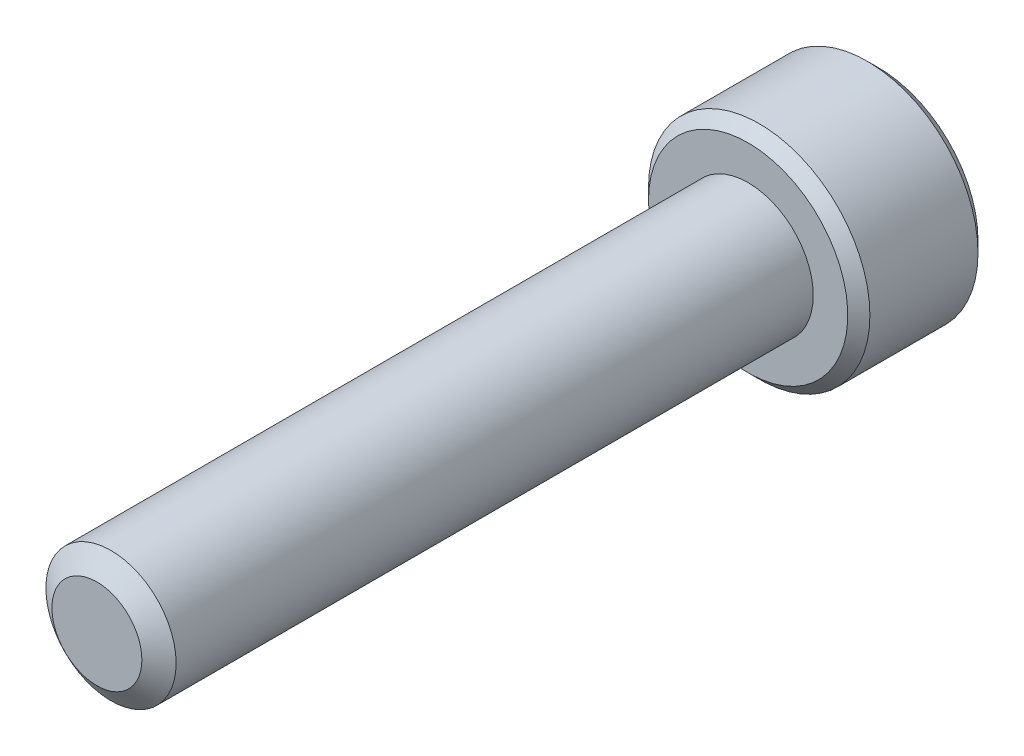
ISO-10303-21;
HEADER;
FILE_DESCRIPTION(('STEP AP214'),'2;1');
FILE_NAME('part.step','',(''),(''),'','','');
FILE_SCHEMA(('AUTOMOTIVE_DESIGN { 1 0 10303 214 1 1 1 1 }'));
ENDSEC;
DATA;
#1=APPLICATION_CONTEXT('core data for automotive mechanical design processes');
#2=APPLICATION_PROTOCOL_DEFINITION('international standard','automotive_design',2000,#1);
#3=PRODUCT_CONTEXT('',#1,'mechanical');
#4=PRODUCT('Part','Part','',(#3));
#5=PRODUCT_RELATED_PRODUCT_CATEGORY('part','',(#4));
#6=PRODUCT_DEFINITION_FORMATION('','',#4);
#7=PRODUCT_DEFINITION_CONTEXT('part definition',#1,'design');
#8=PRODUCT_DEFINITION('design','',#6,#7);
#9=PRODUCT_DEFINITION_SHAPE('','',#8);
#10=(LENGTH_UNIT() NAMED_UNIT(*) SI_UNIT(.MILLI.,.METRE.));
#11=(NAMED_UNIT(*) PLANE_ANGLE_UNIT() SI_UNIT($,.RADIAN.));
#12=(NAMED_UNIT(*) SI_UNIT($,.STERADIAN.) SOLID_ANGLE_UNIT());
#13=UNCERTAINTY_MEASURE_WITH_UNIT(LENGTH_MEASURE(1.E-05),#10,'distance_accuracy_value','');
#14=(GEOMETRIC_REPRESENTATION_CONTEXT(3) GLOBAL_UNCERTAINTY_ASSIGNED_CONTEXT((#13)) GLOBAL_UNIT_ASSIGNED_CONTEXT((#10,
#11,#12)) REPRESENTATION_CONTEXT('',''));
#15=CARTESIAN_POINT('',(0.,0.,0.));
#16=DIRECTION('',(0.,0.,1.));
#17=DIRECTION('',(1.,0.,0.));
#18=AXIS2_PLACEMENT_3D('',#15,#16,#17);
#19=CARTESIAN_POINT('',(0.,0.,-25.));
#20=DIRECTION('',(0.,0.,1.));
#21=DIRECTION('',(1.,0.,0.));
#22=AXIS2_PLACEMENT_3D('',#19,#20,#21);
#23=CYLINDRICAL_SURFACE('',#22,2.5);
#24=CARTESIAN_POINT('',(0.,0.,-25.));
#25=DIRECTION('',(0.,0.,-1.));
#26=DIRECTION('',(-1.,0.,0.));
#27=AXIS2_PLACEMENT_3D('',#24,#25,#26);
#28=CIRCLE('',#27,2.5);
#29=CARTESIAN_POINT('',(-2.5,0.,-25.));
#30=VERTEX_POINT('',#29);
#31=EDGE_CURVE('E213',#30,#30,#28,.F.);
#32=ORIENTED_EDGE('',*,*,#31,.T.);
#33=EDGE_LOOP('',(#32));
#34=FACE_BOUND('',#33,.T.);
#35=CARTESIAN_POINT('',(0.,0.,-0.541691224311848));
#36=DIRECTION('',(0.,0.,1.));
#37=DIRECTION('',(1.,0.,0.));
#38=AXIS2_PLACEMENT_3D('',#35,#36,#37);
#39=CIRCLE('',#38,2.5);
#40=CARTESIAN_POINT('',(2.5,0.,-0.541691224311848));
#41=VERTEX_POINT('',#40);
#42=EDGE_CURVE('E107',#41,#41,#39,.T.);
#43=ORIENTED_EDGE('',*,*,#42,.F.);
#44=EDGE_LOOP('',(#43));
#45=FACE_BOUND('',#44,.T.);
#46=ADVANCED_FACE('F33',(#34,#45),#23,.T.);
#47=CARTESIAN_POINT('',(0.,0.,0.));
#48=DIRECTION('',(0.,0.,-1.));
#49=DIRECTION('',(-1.,0.,0.));
#50=AXIS2_PLACEMENT_3D('',#47,#48,#49);
#51=CONICAL_SURFACE('',#50,1.72638475772933,0.959931088596884);
#52=ORIENTED_EDGE('',*,*,#42,.T.);
#53=EDGE_LOOP('',(#52));
#54=FACE_BOUND('',#53,.T.);
#55=CARTESIAN_POINT('',(0.,0.,0.));
#56=DIRECTION('',(0.,0.,1.));
#57=DIRECTION('',(1.,0.,0.));
#58=AXIS2_PLACEMENT_3D('',#55,#56,#57);
#59=CIRCLE('',#58,1.72638475772933);
#60=CARTESIAN_POINT('',(1.72638475772933,0.,0.));
#61=VERTEX_POINT('',#60);
#62=EDGE_CURVE('E211',#61,#61,#59,.T.);
#63=ORIENTED_EDGE('',*,*,#62,.F.);
#64=EDGE_LOOP('',(#63));
#65=FACE_BOUND('',#64,.T.);
#66=ADVANCED_FACE('F194',(#54,#65),#51,.T.);
#67=CARTESIAN_POINT('',(0.,0.,0.));
#68=DIRECTION('',(0.,0.,1.));
#69=DIRECTION('',(1.,0.,0.));
#70=AXIS2_PLACEMENT_3D('',#67,#68,#69);
#71=PLANE('',#70);
#72=ORIENTED_EDGE('',*,*,#62,.T.);
#73=EDGE_LOOP('',(#72));
#74=FACE_BOUND('',#73,.T.);
#75=ADVANCED_FACE('F191',(#74),#71,.T.);
#76=CARTESIAN_POINT('',(0.,0.,-30.));
#77=DIRECTION('',(0.,0.,1.));
#78=DIRECTION('',(1.,0.,0.));
#79=AXIS2_PLACEMENT_3D('',#76,#77,#78);
#80=CYLINDRICAL_SURFACE('',#79,4.25);
#81=CARTESIAN_POINT('',(0.,0.,-29.575));
#82=DIRECTION('',(0.,0.,-1.));
#83=DIRECTION('',(-1.,0.,0.));
#84=AXIS2_PLACEMENT_3D('',#81,#82,#83);
#85=CIRCLE('',#84,4.25);
#86=CARTESIAN_POINT('',(4.25,0.,-29.575));
#87=VERTEX_POINT('',#86);
#88=EDGE_CURVE('E41',#87,#87,#85,.F.);
#89=ORIENTED_EDGE('',*,*,#88,.T.);
#90=EDGE_LOOP('',(#89));
#91=FACE_BOUND('',#90,.T.);
#92=CARTESIAN_POINT('',(0.,0.,-25.425));
#93=DIRECTION('',(0.,0.,-1.));
#94=DIRECTION('',(-1.,0.,0.));
#95=AXIS2_PLACEMENT_3D('',#92,#93,#94);
#96=CIRCLE('',#95,4.25);
#97=CARTESIAN_POINT('',(-4.25,0.,-25.425));
#98=VERTEX_POINT('',#97);
#99=EDGE_CURVE('E170',#98,#98,#96,.T.);
#100=ORIENTED_EDGE('',*,*,#99,.T.);
#101=EDGE_LOOP('',(#100));
#102=FACE_BOUND('',#101,.T.);
#103=ADVANCED_FACE('F175',(#91,#102),#80,.T.);
#104=CARTESIAN_POINT('',(0.,0.,-30.));
#105=DIRECTION('',(0.,0.,-1.));
#106=DIRECTION('',(-1.,0.,0.));
#107=AXIS2_PLACEMENT_3D('',#104,#105,#106);
#108=PLANE('',#107);
#109=CARTESIAN_POINT('',(0.,0.,-30.));
#110=DIRECTION('',(0.,0.,-1.));
#111=DIRECTION('',(-1.,0.,0.));
#112=AXIS2_PLACEMENT_3D('',#109,#110,#111);
#113=CIRCLE('',#112,3.825);
#114=CARTESIAN_POINT('',(3.825,0.,-30.));
#115=VERTEX_POINT('',#114);
#116=EDGE_CURVE('E106',#115,#115,#113,.T.);
#117=ORIENTED_EDGE('',*,*,#116,.T.);
#118=EDGE_LOOP('',(#117));
#119=FACE_BOUND('',#118,.T.);
#120=CARTESIAN_POINT('',(0.,0.,-30.));
#121=DIRECTION('',(0.,0.,-1.));
#122=DIRECTION('',(-1.,0.,0.));
#123=AXIS2_PLACEMENT_3D('',#120,#121,#122);
#124=CIRCLE('',#123,2.3094010767585);
#125=CARTESIAN_POINT('',(-2.,1.15470053837925,-30.));
#126=VERTEX_POINT('',#125);
#127=CARTESIAN_POINT('',(0.,2.3094010767585,-30.));
#128=VERTEX_POINT('',#127);
#129=EDGE_CURVE('E87',#126,#128,#124,.T.);
#130=ORIENTED_EDGE('',*,*,#129,.F.);
#131=CARTESIAN_POINT('',(-2.,-1.15470053837925,-30.));
#132=VERTEX_POINT('',#131);
#133=EDGE_CURVE('E47',#132,#126,#124,.T.);
#134=ORIENTED_EDGE('',*,*,#133,.F.);
#135=CARTESIAN_POINT('',(0.,-2.3094010767585,-30.));
#136=VERTEX_POINT('',#135);
#137=EDGE_CURVE('E272',#136,#132,#124,.T.);
#138=ORIENTED_EDGE('',*,*,#137,.F.);
#139=CARTESIAN_POINT('',(2.,-1.15470053837925,-30.));
#140=VERTEX_POINT('',#139);
#141=EDGE_CURVE('E54',#140,#136,#124,.T.);
#142=ORIENTED_EDGE('',*,*,#141,.F.);
#143=CARTESIAN_POINT('',(2.,1.15470053837925,-30.));
#144=VERTEX_POINT('',#143);
#145=EDGE_CURVE('E128',#144,#140,#124,.T.);
#146=ORIENTED_EDGE('',*,*,#145,.F.);
#147=EDGE_CURVE('E96',#128,#144,#124,.T.);
#148=ORIENTED_EDGE('',*,*,#147,.F.);
#149=EDGE_LOOP('',(#130,#134,#138,#142,#146,#148));
#150=FACE_BOUND('',#149,.T.);
#151=ADVANCED_FACE('F127',(#119,#150),#108,.T.);
#152=CARTESIAN_POINT('',(0.,0.,-25.));
#153=DIRECTION('',(0.,0.,-1.));
#154=DIRECTION('',(-1.,0.,0.));
#155=AXIS2_PLACEMENT_3D('',#152,#153,#154);
#156=PLANE('',#155);
#157=CARTESIAN_POINT('',(0.,0.,-25.));
#158=DIRECTION('',(0.,0.,-1.));
#159=DIRECTION('',(-1.,0.,0.));
#160=AXIS2_PLACEMENT_3D('',#157,#158,#159);
#161=CIRCLE('',#160,3.82500000000001);
#162=CARTESIAN_POINT('',(-3.82500000000001,0.,-25.));
#163=VERTEX_POINT('',#162);
#164=EDGE_CURVE('E11',#163,#163,#161,.F.);
#165=ORIENTED_EDGE('',*,*,#164,.T.);
#166=EDGE_LOOP('',(#165));
#167=FACE_BOUND('',#166,.T.);
#168=ORIENTED_EDGE('',*,*,#31,.F.);
#169=EDGE_LOOP('',(#168));
#170=FACE_BOUND('',#169,.T.);
#171=ADVANCED_FACE('F184',(#167,#170),#156,.F.);
#172=CARTESIAN_POINT('',(0.,0.,-30.));
#173=DIRECTION('',(0.,0.,-1.));
#174=DIRECTION('',(-1.,0.,0.));
#175=AXIS2_PLACEMENT_3D('',#172,#173,#174);
#176=CONICAL_SURFACE('',#175,2.3094010767585,0.78539816339745);
#177=ORIENTED_EDGE('',*,*,#147,.T.);
#178=CARTESIAN_POINT('',(-0.000199999999998639,2.30951654681234,-30.0001154787137));
#179=CARTESIAN_POINT('',(0.0685530340307068,2.26982196410711,-29.9604530902256));
#180=CARTESIAN_POINT('',(0.138455742135513,2.22946361676572,-29.9231199822842));
#181=CARTESIAN_POINT('',(0.280995244550438,2.1471683966763,-29.8547636851361));
#182=CARTESIAN_POINT('',(0.35364559756536,2.10522369580642,-29.8237785337372));
#183=CARTESIAN_POINT('',(0.500141601053972,2.02064418875706,-29.7707002165441));
#184=CARTESIAN_POINT('',(0.573949935246295,1.97803092714269,-29.7484736271766));
#185=CARTESIAN_POINT('',(0.723191631835264,1.89186619344273,-29.7142288166751));
#186=CARTESIAN_POINT('',(0.798620433918151,1.84831735425552,-29.7021850291441));
#187=CARTESIAN_POINT('',(0.928615500671078,1.7732646674724,-29.6913185119056));
#188=CARTESIAN_POINT('',(0.983013783970108,1.74185780396625,-29.68970975361));
#189=CARTESIAN_POINT('',(1.09172145551969,1.67909540053412,-29.6924188775987));
#190=CARTESIAN_POINT('',(1.14603080592134,1.64773988246022,-29.696738837758));
#191=CARTESIAN_POINT('',(1.25413672758934,1.5853248994842,-29.7110595674099));
#192=CARTESIAN_POINT('',(1.30793265655479,1.55426580541469,-29.721066692762));
#193=CARTESIAN_POINT('',(1.41459426230557,1.49268469862228,-29.7462124302497));
#194=CARTESIAN_POINT('',(1.46746001007071,1.46216264491917,-29.7613506490422));
#195=CARTESIAN_POINT('',(1.60287973308984,1.38397803138049,-29.8062945034292));
#196=CARTESIAN_POINT('',(1.68459383484948,1.33680037273297,-29.8394888394258));
#197=CARTESIAN_POINT('',(1.8047470372578,1.26742988897853,-29.8955258231714));
#198=CARTESIAN_POINT('',(1.84434285210918,1.24456923461531,-29.9152147029469));
#199=CARTESIAN_POINT('',(1.92280095888787,1.19927142554652,-29.9563873183649));
#200=CARTESIAN_POINT('',(1.96166368359374,1.17683402097614,-29.9778699516512));
#201=CARTESIAN_POINT('',(2.0002,1.15458506832541,-30.0001154787137));
#202=B_SPLINE_CURVE_WITH_KNOTS('',3,(#178,#179,#180,#181,#182,#183,#184,#185,#186,#187,#188,
#189,#190,#191,#192,#193,#194,#195,#196,#197,#198,#199,#200,#201),.UNSPECIFIED.,.F.,.F.,(4,2,2,
2,2,2,2,2,2,2,2,4),(0.,0.266420613771063,0.534393751523387,0.798110374376911,1.06116288956936,
1.24939906803721,1.43770123566247,1.62621426093931,1.81471283831913,2.11415604834145,
2.2634717071779,2.4126962696977),.UNSPECIFIED.);
#203=EDGE_CURVE('E101',#128,#144,#202,.T.);
#204=ORIENTED_EDGE('',*,*,#203,.F.);
#205=EDGE_LOOP('',(#177,#204));
#206=FACE_BOUND('',#205,.T.);
#207=ADVANCED_FACE('F102',(#206),#176,.F.);
#208=ORIENTED_EDGE('',*,*,#145,.T.);
#209=CARTESIAN_POINT('',(2.,-2.30294417292923,-30.7407713550277));
#210=CARTESIAN_POINT('',(2.,-2.24687002663712,-30.698443273626));
#211=CARTESIAN_POINT('',(2.,-2.19048190536959,-30.6565251568643));
#212=CARTESIAN_POINT('',(2.,-2.07695390496424,-30.573690417861));
#213=CARTESIAN_POINT('',(2.,-2.01981384066454,-30.5327740496681));
#214=CARTESIAN_POINT('',(2.,-1.90424016804776,-30.4518334520186));
#215=CARTESIAN_POINT('',(2.,-1.8457999674391,-30.4118185915599));
#216=CARTESIAN_POINT('',(2.,-1.7279274546176,-30.3332889936643));
#217=CARTESIAN_POINT('',(2.,-1.66849521292324,-30.2947741502431));
#218=CARTESIAN_POINT('',(2.,-1.4816299571002,-30.1776406516043));
#219=CARTESIAN_POINT('',(2.,-1.35220318163536,-30.1021459017296));
#220=CARTESIAN_POINT('',(2.,-1.08689521592924,-29.9640493509944));
#221=CARTESIAN_POINT('',(2.,-0.951037763938191,-29.9014040859035));
#222=CARTESIAN_POINT('',(2.,-0.747111912259408,-29.8247635438751));
#223=CARTESIAN_POINT('',(2.,-0.682064034147875,-29.8027671799191));
#224=CARTESIAN_POINT('',(2.,-0.550398103294752,-29.7639966876601));
#225=CARTESIAN_POINT('',(2.,-0.483779942722476,-29.7472229191212));
#226=CARTESIAN_POINT('',(2.,-0.350484328847655,-29.7200482578844));
#227=CARTESIAN_POINT('',(2.,-0.283829489364786,-29.7095381767417));
#228=CARTESIAN_POINT('',(2.,-0.149806987139377,-29.6950960855449));
#229=CARTESIAN_POINT('',(2.,-0.0824394489341221,-29.6911629447331));
#230=CARTESIAN_POINT('',(2.,0.0499055622944894,-29.6901664769337));
#231=CARTESIAN_POINT('',(2.,0.114881285143172,-29.6928596448504));
#232=CARTESIAN_POINT('',(2.,0.24427592148276,-29.7044300704227));
#233=CARTESIAN_POINT('',(2.,0.308694780266753,-29.7133079288332));
#234=CARTESIAN_POINT('',(2.,0.437599788610704,-29.7369136592961));
#235=CARTESIAN_POINT('',(2.,0.502067428644594,-29.7517410834465));
#236=CARTESIAN_POINT('',(2.,0.629594322598306,-29.786457883628));
#237=CARTESIAN_POINT('',(2.,0.69265369388315,-29.8063468361063));
#238=CARTESIAN_POINT('',(2.,0.891187889210545,-29.8764469792562));
#239=CARTESIAN_POINT('',(2.,1.02383545707306,-29.9346418003215));
#240=CARTESIAN_POINT('',(2.,1.28290932150074,-30.0640305754596));
#241=CARTESIAN_POINT('',(2.,1.4093111258757,-30.1352712314148));
#242=CARTESIAN_POINT('',(2.,1.59200441438963,-30.2464419918747));
#243=CARTESIAN_POINT('',(2.,1.65027549026191,-30.2831821903374));
#244=CARTESIAN_POINT('',(2.,1.76581760389243,-30.3582145141838));
#245=CARTESIAN_POINT('',(2.,1.82308856543105,-30.396506757118));
#246=CARTESIAN_POINT('',(2.,1.93629654762084,-30.4740422640812));
#247=CARTESIAN_POINT('',(2.,1.99224062500539,-30.5132752761336));
#248=CARTESIAN_POINT('',(2.,2.103364240299,-30.5927788307365));
#249=CARTESIAN_POINT('',(2.,2.15854398422468,-30.6330490850006));
#250=CARTESIAN_POINT('',(2.,2.21340370692658,-30.6737442381459));
#251=B_SPLINE_CURVE_WITH_KNOTS('',3,(#209,#210,#211,#212,#213,#214,#215,#216,#217,#218,#219,
#220,#221,#222,#223,#224,#225,#226,#227,#228,#229,#230,#231,#232,#233,#234,#235,#236,#237,#238,
#239,#240,#241,#242,#243,#244,#245,#246,#247,#248,#249,#250),.UNSPECIFIED.,.F.,.F.,(4,2,2,2,2,2,
2,2,2,2,2,2,2,2,2,2,2,2,2,2,4),(0.,0.210772731976889,0.421598374658589,0.634057554623486,
0.846501695870167,1.29562155455624,1.74319622821645,1.94902062110207,2.15485918928325,
2.35699582502635,2.5590977043214,2.75388435553556,2.94868993014815,3.14690093452585,
3.34509535789702,3.77838155837654,4.21325029921625,4.41989056685647,4.62654651460921,
4.83152377111289,5.03644465914085),.UNSPECIFIED.);
#252=EDGE_CURVE('E95',#144,#140,#251,.F.);
#253=ORIENTED_EDGE('',*,*,#252,.F.);
#254=EDGE_LOOP('',(#208,#253));
#255=FACE_BOUND('',#254,.T.);
#256=ADVANCED_FACE('F278',(#255),#176,.F.);
#257=ORIENTED_EDGE('',*,*,#141,.T.);
#258=CARTESIAN_POINT('',(2.0002,-1.15458506832541,-30.0001154787137));
#259=CARTESIAN_POINT('',(1.93144696596929,-1.19427965103064,-29.9604530902256));
#260=CARTESIAN_POINT('',(1.86154425786449,-1.23463799837204,-29.9231199822842));
#261=CARTESIAN_POINT('',(1.71900475544956,-1.31693321846145,-29.8547636851361));
#262=CARTESIAN_POINT('',(1.64635440243464,-1.35887791933134,-29.8237785337372));
#263=CARTESIAN_POINT('',(1.49985839894603,-1.44345742638069,-29.7707002165441));
#264=CARTESIAN_POINT('',(1.42605006475371,-1.48607068799507,-29.7484736271766));
#265=CARTESIAN_POINT('',(1.27680836816474,-1.57223542169503,-29.7142288166751));
#266=CARTESIAN_POINT('',(1.20137956608185,-1.61578426088223,-29.7021850291441));
#267=CARTESIAN_POINT('',(1.07138449932892,-1.69083694766536,-29.6913185119056));
#268=CARTESIAN_POINT('',(1.01698621602989,-1.72224381117151,-29.68970975361));
#269=CARTESIAN_POINT('',(0.908278544480307,-1.78500621460364,-29.6924188775987));
#270=CARTESIAN_POINT('',(0.853969194078662,-1.81636173267754,-29.696738837758));
#271=CARTESIAN_POINT('',(0.745863272410662,-1.87877671565355,-29.7110595674099));
#272=CARTESIAN_POINT('',(0.692067343445208,-1.90983580972306,-29.721066692762));
#273=CARTESIAN_POINT('',(0.585405737694427,-1.97141691651547,-29.7462124302497));
#274=CARTESIAN_POINT('',(0.532539989929288,-2.00193897021859,-29.7613506490422));
#275=CARTESIAN_POINT('',(0.397120266910157,-2.08012358375727,-29.8062945034292));
#276=CARTESIAN_POINT('',(0.315406165150522,-2.12730124240478,-29.8394888394258));
#277=CARTESIAN_POINT('',(0.195252962742199,-2.19667172615922,-29.8955258231714));
#278=CARTESIAN_POINT('',(0.155657147890825,-2.21953238052245,-29.9152147029469));
#279=CARTESIAN_POINT('',(0.0771990411121297,-2.26483018959123,-29.9563873183649));
#280=CARTESIAN_POINT('',(0.0383363164062613,-2.28726759416161,-29.9778699516512));
#281=CARTESIAN_POINT('',(-0.000199999999999452,-2.30951654681234,-30.0001154787137));
#282=B_SPLINE_CURVE_WITH_KNOTS('',3,(#258,#259,#260,#261,#262,#263,#264,#265,#266,#267,#268,
#269,#270,#271,#272,#273,#274,#275,#276,#277,#278,#279,#280,#281),.UNSPECIFIED.,.F.,.F.,(4,2,2,
2,2,2,2,2,2,2,2,4),(0.,0.266420613771064,0.534393751523388,0.798110374376912,1.06116288956936,
1.24939906803721,1.43770123566247,1.62621426093931,1.81471283831913,2.11415604834144,
2.2634717071779,2.4126962696977),.UNSPECIFIED.);
#283=EDGE_CURVE('E138',#140,#136,#282,.T.);
#284=ORIENTED_EDGE('',*,*,#283,.F.);
#285=EDGE_LOOP('',(#257,#284));
#286=FACE_BOUND('',#285,.T.);
#287=ADVANCED_FACE('F275',(#286),#176,.F.);
#288=ORIENTED_EDGE('',*,*,#137,.T.);
#289=CARTESIAN_POINT('',(0.000199999999999676,-2.30951654681234,-30.0001154787137));
#290=CARTESIAN_POINT('',(-0.0685530340307054,-2.26982196410711,-29.9604530902256));
#291=CARTESIAN_POINT('',(-0.138455742135511,-2.22946361676572,-29.9231199822842));
#292=CARTESIAN_POINT('',(-0.280995244550436,-2.1471683966763,-29.8547636851361));
#293=CARTESIAN_POINT('',(-0.353645597565359,-2.10522369580642,-29.8237785337372));
#294=CARTESIAN_POINT('',(-0.500141601053972,-2.02064418875706,-29.7707002165441));
#295=CARTESIAN_POINT('',(-0.573949935246294,-1.97803092714269,-29.7484736271766));
#296=CARTESIAN_POINT('',(-0.723191631835264,-1.89186619344273,-29.7142288166751));
#297=CARTESIAN_POINT('',(-0.798620433918152,-1.84831735425552,-29.7021850291441));
#298=CARTESIAN_POINT('',(-0.928615500671079,-1.7732646674724,-29.6913185119056));
#299=CARTESIAN_POINT('',(-0.983013783970109,-1.74185780396625,-29.68970975361));
#300=CARTESIAN_POINT('',(-1.09172145551969,-1.67909540053412,-29.6924188775987));
#301=CARTESIAN_POINT('',(-1.14603080592134,-1.64773988246021,-29.696738837758));
#302=CARTESIAN_POINT('',(-1.25413672758934,-1.5853248994842,-29.7110595674099));
#303=CARTESIAN_POINT('',(-1.30793265655479,-1.55426580541469,-29.721066692762));
#304=CARTESIAN_POINT('',(-1.41459426230557,-1.49268469862228,-29.7462124302497));
#305=CARTESIAN_POINT('',(-1.46746001007071,-1.46216264491917,-29.7613506490422));
#306=CARTESIAN_POINT('',(-1.60287973308984,-1.38397803138049,-29.8062945034292));
#307=CARTESIAN_POINT('',(-1.68459383484948,-1.33680037273297,-29.8394888394258));
#308=CARTESIAN_POINT('',(-1.8047470372578,-1.26742988897853,-29.8955258231714));
#309=CARTESIAN_POINT('',(-1.84434285210917,-1.24456923461531,-29.9152147029469));
#310=CARTESIAN_POINT('',(-1.92280095888787,-1.19927142554652,-29.9563873183649));
#311=CARTESIAN_POINT('',(-1.96166368359374,-1.17683402097615,-29.9778699516512));
#312=CARTESIAN_POINT('',(-2.0002,-1.15458506832541,-30.0001154787137));
#313=B_SPLINE_CURVE_WITH_KNOTS('',3,(#289,#290,#291,#292,#293,#294,#295,#296,#297,#298,#299,
#300,#301,#302,#303,#304,#305,#306,#307,#308,#309,#310,#311,#312),.UNSPECIFIED.,.F.,.F.,(4,2,2,
2,2,2,2,2,2,2,2,4),(0.,0.266420613771063,0.534393751523388,0.798110374376913,1.06116288956936,
1.24939906803721,1.43770123566247,1.62621426093931,1.81471283831913,2.11415604834144,
2.2634717071779,2.4126962696977),.UNSPECIFIED.);
#314=EDGE_CURVE('E249',#136,#132,#313,.T.);
#315=ORIENTED_EDGE('',*,*,#314,.F.);
#316=EDGE_LOOP('',(#288,#315));
#317=FACE_BOUND('',#316,.T.);
#318=ADVANCED_FACE('F274',(#317),#176,.F.);
#319=ORIENTED_EDGE('',*,*,#133,.T.);
#320=CARTESIAN_POINT('',(-2.,-2.3029441732643,-30.7407713552807));
#321=CARTESIAN_POINT('',(-2.,-2.24687002696278,-30.6984432738692));
#322=CARTESIAN_POINT('',(-2.,-2.19048190568582,-30.6565251570978));
#323=CARTESIAN_POINT('',(-2.,-2.07695390526152,-30.5736904180751));
#324=CARTESIAN_POINT('',(-2.,-2.01981384095229,-30.5327740498725));
#325=CARTESIAN_POINT('',(-2.,-1.90424016831613,-30.4518334522036));
#326=CARTESIAN_POINT('',(-2.,-1.84579996769762,-30.4118185917352));
#327=CARTESIAN_POINT('',(-2.,-1.72792745485625,-30.3332889938203));
#328=CARTESIAN_POINT('',(-2.,-1.66849521315186,-30.2947741503895));
#329=CARTESIAN_POINT('',(-2.,-1.48162995729573,-30.1776406517203));
#330=CARTESIAN_POINT('',(-2.,-1.35220318180736,-30.1021459018253));
#331=CARTESIAN_POINT('',(-2.,-1.08689521605219,-29.9640493510523));
#332=CARTESIAN_POINT('',(-2.,-0.951037764035625,-29.901404085944));
#333=CARTESIAN_POINT('',(-2.,-0.747111912337647,-29.8247635439028));
#334=CARTESIAN_POINT('',(-2.,-0.682064034234151,-29.8027671799472));
#335=CARTESIAN_POINT('',(-2.,-0.550398103397368,-29.7639966876876));
#336=CARTESIAN_POINT('',(-2.,-0.483779942833393,-29.7472229191476));
#337=CARTESIAN_POINT('',(-2.,-0.350484328974902,-29.7200482579067));
#338=CARTESIAN_POINT('',(-2.,-0.283829489500056,-29.709538176761));
#339=CARTESIAN_POINT('',(-2.,-0.149806987290426,-29.6950960855565));
#340=CARTESIAN_POINT('',(-2.,-0.0824394490929264,-29.6911629447399));
#341=CARTESIAN_POINT('',(-2.,0.0499055621213769,-29.6901664769296));
#342=CARTESIAN_POINT('',(-2.,0.114881284963486,-29.6928596448403));
#343=CARTESIAN_POINT('',(-2.,0.244275921290585,-29.7044300703996));
#344=CARTESIAN_POINT('',(-2.,0.308694780068662,-29.7133079288031));
#345=CARTESIAN_POINT('',(-2.,0.437599788400935,-29.7369136592514));
#346=CARTESIAN_POINT('',(-2.,0.502067428429079,-29.7517410833941));
#347=CARTESIAN_POINT('',(-2.,0.629594322371855,-29.78645788356));
#348=CARTESIAN_POINT('',(-2.,0.692653693651508,-29.8063468360305));
#349=CARTESIAN_POINT('',(-2.,0.891187888928462,-29.8764469791434));
#350=CARTESIAN_POINT('',(-2.,1.02383545674826,-29.9346418001747));
#351=CARTESIAN_POINT('',(-2.,1.28290932109377,-30.0640305752409));
#352=CARTESIAN_POINT('',(-2.,1.40931112542931,-30.1352712311583));
#353=CARTESIAN_POINT('',(-2.,1.59200441388854,-30.2464419915627));
#354=CARTESIAN_POINT('',(-2.,1.6502754897448,-30.2831821900083));
#355=CARTESIAN_POINT('',(-2.,1.76581760334353,-30.3582145138205));
#356=CARTESIAN_POINT('',(-2.,1.82308856486637,-30.3965067567377));
#357=CARTESIAN_POINT('',(-2.,1.93629654702499,-30.4740422636668));
#358=CARTESIAN_POINT('',(-2.,1.99224062439413,-30.5132752757022));
#359=CARTESIAN_POINT('',(-2.,2.10336423965704,-30.5927788302713));
#360=CARTESIAN_POINT('',(-2.,2.15854398356742,-30.6330490845185));
#361=CARTESIAN_POINT('',(-2.,2.21340370625405,-30.6737442376469));
#362=B_SPLINE_CURVE_WITH_KNOTS('',3,(#320,#321,#322,#323,#324,#325,#326,#327,#328,#329,#330,
#331,#332,#333,#334,#335,#336,#337,#338,#339,#340,#341,#342,#343,#344,#345,#346,#347,#348,#349,
#350,#351,#352,#353,#354,#355,#356,#357,#358,#359,#360,#361),.UNSPECIFIED.,.F.,.F.,(4,2,2,2,2,2,
2,2,2,2,2,2,2,2,2,2,2,2,2,2,4),(0.,0.210772732017009,0.421598374738841,0.634057554744624,
0.846501696032183,1.29562155480994,1.74319622856096,1.94902062142334,2.15485918958132,
2.35699582530216,2.55909770457495,2.75388435576874,2.94868993036093,3.14690093471669,
3.34509535806591,3.77838155838771,4.21325029906866,4.41989056664096,4.62654651432578,
4.83152377076247,5.03644465872343),.UNSPECIFIED.);
#363=EDGE_CURVE('E117',#132,#126,#362,.T.);
#364=ORIENTED_EDGE('',*,*,#363,.F.);
#365=EDGE_LOOP('',(#319,#364));
#366=FACE_BOUND('',#365,.T.);
#367=ADVANCED_FACE('F287',(#366),#176,.F.);
#368=ORIENTED_EDGE('',*,*,#129,.T.);
#369=CARTESIAN_POINT('',(-2.0002,1.15458506832541,-30.0001154787137));
#370=CARTESIAN_POINT('',(-1.93144696596929,1.19427965103065,-29.9604530902256));
#371=CARTESIAN_POINT('',(-1.86154425786449,1.23463799837204,-29.9231199822842));
#372=CARTESIAN_POINT('',(-1.71900475544956,1.31693321846145,-29.8547636851361));
#373=CARTESIAN_POINT('',(-1.64635440243464,1.35887791933134,-29.8237785337372));
#374=CARTESIAN_POINT('',(-1.49985839894603,1.44345742638069,-29.7707002165441));
#375=CARTESIAN_POINT('',(-1.4260500647537,1.48607068799507,-29.7484736271766));
#376=CARTESIAN_POINT('',(-1.27680836816473,1.57223542169503,-29.7142288166751));
#377=CARTESIAN_POINT('',(-1.20137956608185,1.61578426088223,-29.7021850291441));
#378=CARTESIAN_POINT('',(-1.07138449932892,1.69083694766536,-29.6913185119056));
#379=CARTESIAN_POINT('',(-1.01698621602989,1.72224381117151,-29.68970975361));
#380=CARTESIAN_POINT('',(-0.908278544480304,1.78500621460364,-29.6924188775987));
#381=CARTESIAN_POINT('',(-0.853969194078659,1.81636173267754,-29.696738837758));
#382=CARTESIAN_POINT('',(-0.74586327241066,1.87877671565355,-29.7110595674099));
#383=CARTESIAN_POINT('',(-0.692067343445206,1.90983580972306,-29.721066692762));
#384=CARTESIAN_POINT('',(-0.585405737694425,1.97141691651548,-29.7462124302497));
#385=CARTESIAN_POINT('',(-0.532539989929286,2.00193897021859,-29.7613506490422));
#386=CARTESIAN_POINT('',(-0.397120266910154,2.08012358375727,-29.8062945034292));
#387=CARTESIAN_POINT('',(-0.31540616515052,2.12730124240478,-29.8394888394258));
#388=CARTESIAN_POINT('',(-0.195252962742197,2.19667172615922,-29.8955258231714));
#389=CARTESIAN_POINT('',(-0.155657147890823,2.21953238052245,-29.9152147029469));
#390=CARTESIAN_POINT('',(-0.0771990411121286,2.26483018959123,-29.9563873183649));
#391=CARTESIAN_POINT('',(-0.0383363164062601,2.28726759416161,-29.9778699516512));
#392=CARTESIAN_POINT('',(0.000200000000000233,2.30951654681234,-30.0001154787137));
#393=B_SPLINE_CURVE_WITH_KNOTS('',3,(#369,#370,#371,#372,#373,#374,#375,#376,#377,#378,#379,
#380,#381,#382,#383,#384,#385,#386,#387,#388,#389,#390,#391,#392),.UNSPECIFIED.,.F.,.F.,(4,2,2,
2,2,2,2,2,2,2,2,4),(0.,0.266420613771063,0.534393751523388,0.798110374376913,1.06116288956936,
1.24939906803722,1.43770123566247,1.62621426093932,1.81471283831913,2.11415604834145,
2.2634717071779,2.4126962696977),.UNSPECIFIED.);
#394=EDGE_CURVE('E91',#126,#128,#393,.T.);
#395=ORIENTED_EDGE('',*,*,#394,.F.);
#396=EDGE_LOOP('',(#368,#395));
#397=FACE_BOUND('',#396,.T.);
#398=ADVANCED_FACE('F89',(#397),#176,.F.);
#399=CARTESIAN_POINT('',(2.,3.46410161513775,-27.));
#400=DIRECTION('',(0.,0.,-1.));
#401=DIRECTION('',(-1.,0.,0.));
#402=AXIS2_PLACEMENT_3D('',#399,#400,#401);
#403=PLANE('',#402);
#404=DIRECTION('',(0.866025403784439,0.5,0.));
#405=VECTOR('',#404,1.);
#406=CARTESIAN_POINT('',(-2.,1.15470053837925,-27.));
#407=LINE('',#406,#405);
#408=CARTESIAN_POINT('',(-2.,1.15470053837925,-27.));
#409=VERTEX_POINT('',#408);
#410=CARTESIAN_POINT('',(0.,2.3094010767585,-27.));
#411=VERTEX_POINT('',#410);
#412=EDGE_CURVE('E116',#409,#411,#407,.T.);
#413=ORIENTED_EDGE('',*,*,#412,.T.);
#414=DIRECTION('',(0.866025403784439,-0.5,0.));
#415=VECTOR('',#414,1.);
#416=CARTESIAN_POINT('',(0.,2.3094010767585,-27.));
#417=LINE('',#416,#415);
#418=CARTESIAN_POINT('',(2.,1.15470053837925,-27.));
#419=VERTEX_POINT('',#418);
#420=EDGE_CURVE('E121',#411,#419,#417,.T.);
#421=ORIENTED_EDGE('',*,*,#420,.T.);
#422=DIRECTION('',(0.,-1.,0.));
#423=VECTOR('',#422,1.);
#424=CARTESIAN_POINT('',(2.,1.15470053837925,-27.));
#425=LINE('',#424,#423);
#426=CARTESIAN_POINT('',(2.,-1.15470053837925,-27.));
#427=VERTEX_POINT('',#426);
#428=EDGE_CURVE('E235',#419,#427,#425,.T.);
#429=ORIENTED_EDGE('',*,*,#428,.T.);
#430=DIRECTION('',(-0.866025403784438,-0.5,0.));
#431=VECTOR('',#430,1.);
#432=CARTESIAN_POINT('',(2.,-1.15470053837925,-27.));
#433=LINE('',#432,#431);
#434=CARTESIAN_POINT('',(0.,-2.3094010767585,-27.));
#435=VERTEX_POINT('',#434);
#436=EDGE_CURVE('E232',#427,#435,#433,.T.);
#437=ORIENTED_EDGE('',*,*,#436,.T.);
#438=DIRECTION('',(-0.866025403784439,0.5,0.));
#439=VECTOR('',#438,1.);
#440=CARTESIAN_POINT('',(0.,-2.3094010767585,-27.));
#441=LINE('',#440,#439);
#442=CARTESIAN_POINT('',(-2.,-1.15470053837925,-27.));
#443=VERTEX_POINT('',#442);
#444=EDGE_CURVE('E229',#435,#443,#441,.T.);
#445=ORIENTED_EDGE('',*,*,#444,.T.);
#446=DIRECTION('',(0.,1.,0.));
#447=VECTOR('',#446,1.);
#448=CARTESIAN_POINT('',(-2.,-1.15470053837925,-27.));
#449=LINE('',#448,#447);
#450=EDGE_CURVE('E124',#443,#409,#449,.T.);
#451=ORIENTED_EDGE('',*,*,#450,.T.);
#452=EDGE_LOOP('',(#413,#421,#429,#437,#445,#451));
#453=FACE_BOUND('',#452,.T.);
#454=ADVANCED_FACE('F158',(#453),#403,.T.);
#455=CARTESIAN_POINT('',(0.,2.3094010767585,-27.));
#456=DIRECTION('',(0.5,0.866025403784439,0.));
#457=DIRECTION('',(-0.866025403784439,0.5,0.));
#458=AXIS2_PLACEMENT_3D('',#455,#456,#457);
#459=PLANE('',#458);
#460=DIRECTION('',(0.,0.,-1.));
#461=VECTOR('',#460,1.);
#462=CARTESIAN_POINT('',(0.,2.3094010767585,-27.));
#463=LINE('',#462,#461);
#464=EDGE_CURVE('E113',#411,#128,#463,.T.);
#465=ORIENTED_EDGE('',*,*,#464,.T.);
#466=ORIENTED_EDGE('',*,*,#203,.T.);
#467=DIRECTION('',(0.,0.,-1.));
#468=VECTOR('',#467,1.);
#469=CARTESIAN_POINT('',(2.,1.15470053837925,-27.));
#470=LINE('',#469,#468);
#471=EDGE_CURVE('E123',#419,#144,#470,.T.);
#472=ORIENTED_EDGE('',*,*,#471,.F.);
#473=ORIENTED_EDGE('',*,*,#420,.F.);
#474=EDGE_LOOP('',(#465,#466,#472,#473));
#475=FACE_BOUND('',#474,.T.);
#476=ADVANCED_FACE('F119',(#475),#459,.F.);
#477=CARTESIAN_POINT('',(2.,1.15470053837925,-27.));
#478=DIRECTION('',(1.,0.,0.));
#479=DIRECTION('',(0.,0.,-1.));
#480=AXIS2_PLACEMENT_3D('',#477,#478,#479);
#481=PLANE('',#480);
#482=ORIENTED_EDGE('',*,*,#471,.T.);
#483=ORIENTED_EDGE('',*,*,#252,.T.);
#484=DIRECTION('',(0.,0.,-1.));
#485=VECTOR('',#484,1.);
#486=CARTESIAN_POINT('',(2.,-1.15470053837925,-27.));
#487=LINE('',#486,#485);
#488=EDGE_CURVE('E218',#427,#140,#487,.T.);
#489=ORIENTED_EDGE('',*,*,#488,.F.);
#490=ORIENTED_EDGE('',*,*,#428,.F.);
#491=EDGE_LOOP('',(#482,#483,#489,#490));
#492=FACE_BOUND('',#491,.T.);
#493=ADVANCED_FACE('F147',(#492),#481,.F.);
#494=CARTESIAN_POINT('',(2.,-1.15470053837925,-27.));
#495=DIRECTION('',(0.5,-0.866025403784439,0.));
#496=DIRECTION('',(0.866025403784439,0.5,0.));
#497=AXIS2_PLACEMENT_3D('',#494,#495,#496);
#498=PLANE('',#497);
#499=ORIENTED_EDGE('',*,*,#488,.T.);
#500=ORIENTED_EDGE('',*,*,#283,.T.);
#501=DIRECTION('',(0.,0.,-1.));
#502=VECTOR('',#501,1.);
#503=CARTESIAN_POINT('',(0.,-2.3094010767585,-27.));
#504=LINE('',#503,#502);
#505=EDGE_CURVE('E221',#435,#136,#504,.T.);
#506=ORIENTED_EDGE('',*,*,#505,.F.);
#507=ORIENTED_EDGE('',*,*,#436,.F.);
#508=EDGE_LOOP('',(#499,#500,#506,#507));
#509=FACE_BOUND('',#508,.T.);
#510=ADVANCED_FACE('F151',(#509),#498,.F.);
#511=CARTESIAN_POINT('',(0.,-2.3094010767585,-27.));
#512=DIRECTION('',(-0.5,-0.866025403784439,0.));
#513=DIRECTION('',(0.866025403784439,-0.5,0.));
#514=AXIS2_PLACEMENT_3D('',#511,#512,#513);
#515=PLANE('',#514);
#516=ORIENTED_EDGE('',*,*,#505,.T.);
#517=ORIENTED_EDGE('',*,*,#314,.T.);
#518=DIRECTION('',(0.,0.,-1.));
#519=VECTOR('',#518,1.);
#520=CARTESIAN_POINT('',(-2.,-1.15470053837925,-27.));
#521=LINE('',#520,#519);
#522=EDGE_CURVE('E224',#443,#132,#521,.T.);
#523=ORIENTED_EDGE('',*,*,#522,.F.);
#524=ORIENTED_EDGE('',*,*,#444,.F.);
#525=EDGE_LOOP('',(#516,#517,#523,#524));
#526=FACE_BOUND('',#525,.T.);
#527=ADVANCED_FACE('F257',(#526),#515,.F.);
#528=CARTESIAN_POINT('',(-2.,-1.15470053837925,-27.));
#529=DIRECTION('',(-1.,0.,0.));
#530=DIRECTION('',(0.,-1.,0.));
#531=AXIS2_PLACEMENT_3D('',#528,#529,#530);
#532=PLANE('',#531);
#533=ORIENTED_EDGE('',*,*,#522,.T.);
#534=ORIENTED_EDGE('',*,*,#363,.T.);
#535=DIRECTION('',(0.,0.,-1.));
#536=VECTOR('',#535,1.);
#537=CARTESIAN_POINT('',(-2.,1.15470053837925,-27.));
#538=LINE('',#537,#536);
#539=EDGE_CURVE('E115',#409,#126,#538,.T.);
#540=ORIENTED_EDGE('',*,*,#539,.F.);
#541=ORIENTED_EDGE('',*,*,#450,.F.);
#542=EDGE_LOOP('',(#533,#534,#540,#541));
#543=FACE_BOUND('',#542,.T.);
#544=ADVANCED_FACE('F254',(#543),#532,.F.);
#545=CARTESIAN_POINT('',(-2.,1.15470053837925,-27.));
#546=DIRECTION('',(-0.5,0.866025403784439,0.));
#547=DIRECTION('',(-0.866025403784439,-0.5,0.));
#548=AXIS2_PLACEMENT_3D('',#545,#546,#547);
#549=PLANE('',#548);
#550=ORIENTED_EDGE('',*,*,#539,.T.);
#551=ORIENTED_EDGE('',*,*,#394,.T.);
#552=ORIENTED_EDGE('',*,*,#464,.F.);
#553=ORIENTED_EDGE('',*,*,#412,.F.);
#554=EDGE_LOOP('',(#550,#551,#552,#553));
#555=FACE_BOUND('',#554,.T.);
#556=ADVANCED_FACE('F111',(#555),#549,.F.);
#557=CARTESIAN_POINT('',(0.,0.,-30.));
#558=DIRECTION('',(0.,0.,1.));
#559=DIRECTION('',(1.,0.,0.));
#560=AXIS2_PLACEMENT_3D('',#557,#558,#559);
#561=CONICAL_SURFACE('',#560,3.825,0.785398163397448);
#562=CARTESIAN_POINT('',(4.25,0.,-29.575));
#563=CARTESIAN_POINT('',(4.24557291666667,0.,-29.5794270833333));
#564=CARTESIAN_POINT('',(4.24114583333333,0.,-29.5838541666667));
#565=CARTESIAN_POINT('',(4.23229166666667,0.,-29.5927083333333));
#566=CARTESIAN_POINT('',(4.22786458333333,0.,-29.5971354166667));
#567=CARTESIAN_POINT('',(4.21901041666667,0.,-29.6059895833333));
#568=CARTESIAN_POINT('',(4.21458333333334,0.,-29.6104166666667));
#569=CARTESIAN_POINT('',(4.20572916666667,0.,-29.6192708333333));
#570=CARTESIAN_POINT('',(4.20130208333334,0.,-29.6236979166667));
#571=CARTESIAN_POINT('',(4.19244791666667,0.,-29.6325520833333));
#572=CARTESIAN_POINT('',(4.18802083333334,0.,-29.6369791666667));
#573=CARTESIAN_POINT('',(4.17916666666667,0.,-29.6458333333333));
#574=CARTESIAN_POINT('',(4.17473958333334,0.,-29.6502604166667));
#575=CARTESIAN_POINT('',(4.16588541666667,0.,-29.6591145833333));
#576=CARTESIAN_POINT('',(4.16145833333334,0.,-29.6635416666667));
#577=CARTESIAN_POINT('',(4.15260416666667,0.,-29.6723958333333));
#578=CARTESIAN_POINT('',(4.14817708333334,0.,-29.6768229166667));
#579=CARTESIAN_POINT('',(4.13932291666667,0.,-29.6856770833333));
#580=CARTESIAN_POINT('',(4.13489583333333,0.,-29.6901041666667));
#581=CARTESIAN_POINT('',(4.12604166666667,0.,-29.6989583333333));
#582=CARTESIAN_POINT('',(4.12161458333333,0.,-29.7033854166667));
#583=CARTESIAN_POINT('',(4.11276041666667,0.,-29.7122395833333));
#584=CARTESIAN_POINT('',(4.10833333333333,0.,-29.7166666666667));
#585=CARTESIAN_POINT('',(4.09947916666667,0.,-29.7255208333333));
#586=CARTESIAN_POINT('',(4.09505208333333,0.,-29.7299479166667));
#587=CARTESIAN_POINT('',(4.08619791666667,0.,-29.7388020833333));
#588=CARTESIAN_POINT('',(4.08177083333333,0.,-29.7432291666667));
#589=CARTESIAN_POINT('',(4.07291666666667,0.,-29.7520833333333));
#590=CARTESIAN_POINT('',(4.06848958333333,0.,-29.7565104166667));
#591=CARTESIAN_POINT('',(4.05963541666667,0.,-29.7653645833333));
#592=CARTESIAN_POINT('',(4.05520833333334,0.,-29.7697916666667));
#593=CARTESIAN_POINT('',(4.04635416666667,0.,-29.7786458333333));
#594=CARTESIAN_POINT('',(4.04192708333334,0.,-29.7830729166667));
#595=CARTESIAN_POINT('',(4.03307291666667,0.,-29.7919270833333));
#596=CARTESIAN_POINT('',(4.02864583333333,0.,-29.7963541666667));
#597=CARTESIAN_POINT('',(4.01979166666667,0.,-29.8052083333333));
#598=CARTESIAN_POINT('',(4.01536458333333,0.,-29.8096354166667));
#599=CARTESIAN_POINT('',(4.00651041666667,0.,-29.8184895833333));
#600=CARTESIAN_POINT('',(4.00208333333333,0.,-29.8229166666667));
#601=CARTESIAN_POINT('',(3.99322916666667,0.,-29.8317708333333));
#602=CARTESIAN_POINT('',(3.98880208333333,0.,-29.8361979166667));
#603=CARTESIAN_POINT('',(3.97994791666667,0.,-29.8450520833333));
#604=CARTESIAN_POINT('',(3.97552083333333,0.,-29.8494791666667));
#605=CARTESIAN_POINT('',(3.96666666666667,0.,-29.8583333333333));
#606=CARTESIAN_POINT('',(3.96223958333333,0.,-29.8627604166667));
#607=CARTESIAN_POINT('',(3.95338541666667,0.,-29.8716145833333));
#608=CARTESIAN_POINT('',(3.94895833333333,0.,-29.8760416666667));
#609=CARTESIAN_POINT('',(3.94010416666667,0.,-29.8848958333333));
#610=CARTESIAN_POINT('',(3.93567708333333,0.,-29.8893229166667));
#611=CARTESIAN_POINT('',(3.92682291666667,0.,-29.8981770833333));
#612=CARTESIAN_POINT('',(3.92239583333333,0.,-29.9026041666667));
#613=CARTESIAN_POINT('',(3.91354166666667,0.,-29.9114583333333));
#614=CARTESIAN_POINT('',(3.90911458333333,0.,-29.9158854166667));
#615=CARTESIAN_POINT('',(3.90026041666667,0.,-29.9247395833333));
#616=CARTESIAN_POINT('',(3.89583333333333,0.,-29.9291666666667));
#617=CARTESIAN_POINT('',(3.88697916666667,0.,-29.9380208333333));
#618=CARTESIAN_POINT('',(3.88255208333333,0.,-29.9424479166667));
#619=CARTESIAN_POINT('',(3.87369791666667,0.,-29.9513020833333));
#620=CARTESIAN_POINT('',(3.86927083333333,0.,-29.9557291666667));
#621=CARTESIAN_POINT('',(3.86041666666667,0.,-29.9645833333333));
#622=CARTESIAN_POINT('',(3.85598958333333,0.,-29.9690104166667));
#623=CARTESIAN_POINT('',(3.84713541666667,0.,-29.9778645833333));
#624=CARTESIAN_POINT('',(3.84270833333333,0.,-29.9822916666667));
#625=CARTESIAN_POINT('',(3.83385416666667,0.,-29.9911458333333));
#626=CARTESIAN_POINT('',(3.82942708333333,0.,-29.9955729166667));
#627=CARTESIAN_POINT('',(3.825,0.,-30.));
#628=B_SPLINE_CURVE_WITH_KNOTS('',3,(#562,#563,#564,#565,#566,#567,#568,#569,#570,#571,#572,
#573,#574,#575,#576,#577,#578,#579,#580,#581,#582,#583,#584,#585,#586,#587,#588,#589,#590,#591,
#592,#593,#594,#595,#596,#597,#598,#599,#600,#601,#602,#603,#604,#605,#606,#607,#608,#609,#610,
#611,#612,#613,#614,#615,#616,#617,#618,#619,#620,#621,#622,#623,#624,#625,#626,#627),
.UNSPECIFIED.,.F.,.F.,(4,2,2,2,2,2,2,2,2,2,2,2,2,2,2,2,2,2,2,2,2,2,2,2,2,2,2,2,2,2,2,2,4),(0.,
0.0187825238752656,0.0375650477505337,0.0563475716258011,0.0751300955010692,0.0939126193763372,
0.112695143251605,0.131477667126873,0.150260191002141,0.169042714877409,0.187825238752677,
0.206607762627944,0.225390286503212,0.24417281037848,0.262955334253748,0.281737858129016,
0.300520382004284,0.31930290587955,0.338085429754818,0.356867953630085,0.375650477505353,
0.394433001380621,0.413215525255889,0.431998049131157,0.450780573006425,0.469563096881693,
0.48834562075696,0.507128144632228,0.525910668507496,0.544693192382764,0.563475716258032,
0.5822582401333,0.601040764008568),.UNSPECIFIED.);
#629=EDGE_CURVE('BSEAM178',#87,#115,#628,.T.);
#630=ORIENTED_EDGE('',*,*,#88,.F.);
#631=ORIENTED_EDGE('',*,*,#116,.F.);
#632=ORIENTED_EDGE('',*,*,#629,.T.);
#633=ORIENTED_EDGE('',*,*,#629,.F.);
#634=EDGE_LOOP('',(#630,#632,#631,#633));
#635=FACE_BOUND('',#634,.T.);
#636=ADVANCED_FACE('F178',(#635),#561,.T.);
#637=CARTESIAN_POINT('',(0.,0.,-25.425));
#638=DIRECTION('',(0.,0.,-1.));
#639=DIRECTION('',(-1.,0.,0.));
#640=AXIS2_PLACEMENT_3D('',#637,#638,#639);
#641=CONICAL_SURFACE('',#640,4.25,0.785398163397448);
#642=ORIENTED_EDGE('',*,*,#164,.F.);
#643=EDGE_LOOP('',(#642));
#644=FACE_BOUND('',#643,.T.);
#645=ORIENTED_EDGE('',*,*,#99,.F.);
#646=EDGE_LOOP('',(#645));
#647=FACE_BOUND('',#646,.T.);
#648=ADVANCED_FACE('F35',(#644,#647),#641,.T.);
#649=CLOSED_SHELL('',(#46,#66,#75,#103,#151,#171,#207,#256,#287,#318,#367,#398,#454,#476,#493,
#510,#527,#544,#556,#636,#648));
#650=MANIFOLD_SOLID_BREP('B2',#649);
#651=ADVANCED_BREP_SHAPE_REPRESENTATION('',(#18,#650),#14);
#652=SHAPE_DEFINITION_REPRESENTATION(#9,#651);
ENDSEC;
END-ISO-10303-21;
